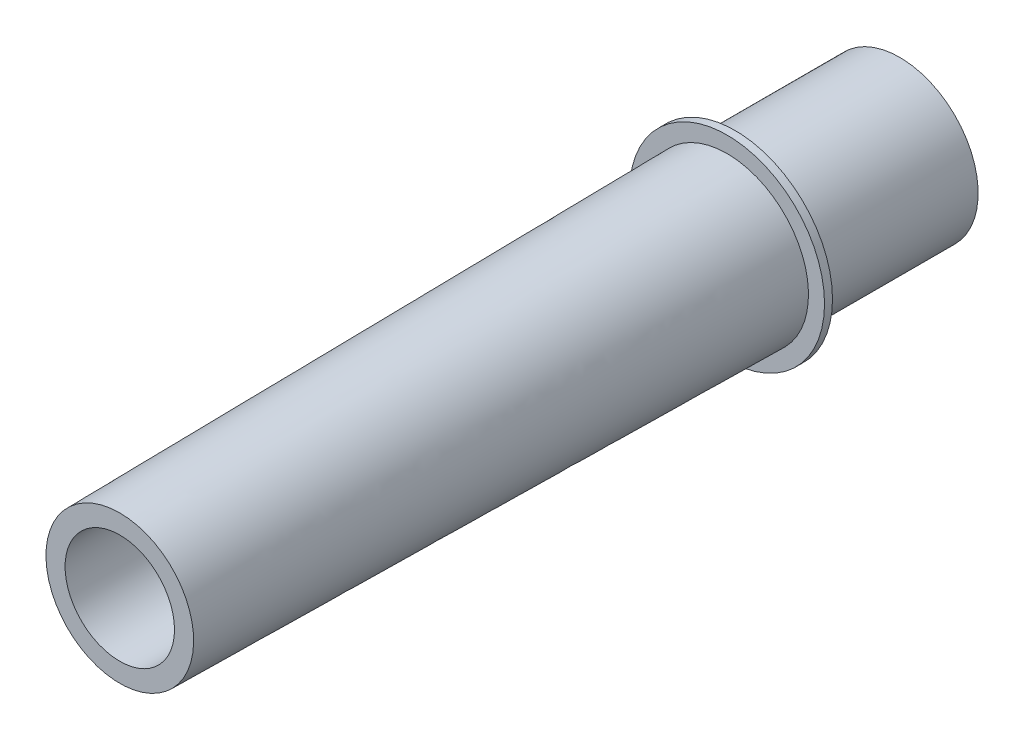
ISO-10303-21;
HEADER;
FILE_DESCRIPTION(('STEP AP214'),'2;1');
FILE_NAME('part.step','',(''),(''),'','','');
FILE_SCHEMA(('AUTOMOTIVE_DESIGN { 1 0 10303 214 1 1 1 1 }'));
ENDSEC;
DATA;
#1=APPLICATION_CONTEXT('core data for automotive mechanical design processes');
#2=APPLICATION_PROTOCOL_DEFINITION('international standard','automotive_design',2000,#1);
#3=PRODUCT_CONTEXT('',#1,'mechanical');
#4=PRODUCT('Part','Part','',(#3));
#5=PRODUCT_RELATED_PRODUCT_CATEGORY('part','',(#4));
#6=PRODUCT_DEFINITION_FORMATION('','',#4);
#7=PRODUCT_DEFINITION_CONTEXT('part definition',#1,'design');
#8=PRODUCT_DEFINITION('design','',#6,#7);
#9=PRODUCT_DEFINITION_SHAPE('','',#8);
#10=(LENGTH_UNIT() NAMED_UNIT(*) SI_UNIT(.MILLI.,.METRE.));
#11=(NAMED_UNIT(*) PLANE_ANGLE_UNIT() SI_UNIT($,.RADIAN.));
#12=(NAMED_UNIT(*) SI_UNIT($,.STERADIAN.) SOLID_ANGLE_UNIT());
#13=UNCERTAINTY_MEASURE_WITH_UNIT(LENGTH_MEASURE(1.E-05),#10,'distance_accuracy_value','');
#14=(GEOMETRIC_REPRESENTATION_CONTEXT(3) GLOBAL_UNCERTAINTY_ASSIGNED_CONTEXT((#13)) GLOBAL_UNIT_ASSIGNED_CONTEXT((#10,
#11,#12)) REPRESENTATION_CONTEXT('',''));
#15=CARTESIAN_POINT('',(0.,0.,0.));
#16=DIRECTION('',(0.,0.,1.));
#17=DIRECTION('',(1.,0.,0.));
#18=AXIS2_PLACEMENT_3D('',#15,#16,#17);
#19=CARTESIAN_POINT('',(-4.044182834782E-13,0.,-57.915));
#20=DIRECTION('',(0.,0.,-1.));
#21=DIRECTION('',(-1.,0.,0.));
#22=AXIS2_PLACEMENT_3D('',#19,#20,#21);
#23=PLANE('',#22);
#24=CARTESIAN_POINT('',(-4.044182834782E-13,0.,-57.915));
#25=DIRECTION('',(0.,0.,-1.));
#26=DIRECTION('',(-1.,0.,0.));
#27=AXIS2_PLACEMENT_3D('',#24,#25,#26);
#28=CIRCLE('',#27,9.175);
#29=CARTESIAN_POINT('',(-9.17500000000041,0.,-57.9149999999999));
#30=VERTEX_POINT('',#29);
#31=EDGE_CURVE('E220',#30,#30,#28,.T.);
#32=ORIENTED_EDGE('',*,*,#31,.T.);
#33=EDGE_LOOP('',(#32));
#34=FACE_BOUND('',#33,.T.);
#35=CARTESIAN_POINT('',(-4.044182834782E-13,0.,-57.915));
#36=DIRECTION('',(0.,0.,-1.));
#37=DIRECTION('',(-1.,0.,0.));
#38=AXIS2_PLACEMENT_3D('',#35,#36,#37);
#39=CIRCLE('',#38,7.385);
#40=CARTESIAN_POINT('',(-7.3850000000004,0.,-57.9149999999999));
#41=VERTEX_POINT('',#40);
#42=EDGE_CURVE('E216',#41,#41,#39,.T.);
#43=ORIENTED_EDGE('',*,*,#42,.F.);
#44=EDGE_LOOP('',(#43));
#45=FACE_BOUND('',#44,.T.);
#46=ADVANCED_FACE('F69',(#34,#45),#23,.T.);
#47=CARTESIAN_POINT('',(-4.044182834782E-13,0.,-57.915));
#48=DIRECTION('',(0.,0.,1.));
#49=DIRECTION('',(1.,0.,0.));
#50=AXIS2_PLACEMENT_3D('',#47,#48,#49);
#51=CYLINDRICAL_SURFACE('',#50,9.175);
#52=ORIENTED_EDGE('',*,*,#31,.F.);
#53=EDGE_LOOP('',(#52));
#54=FACE_BOUND('',#53,.T.);
#55=CARTESIAN_POINT('',(-3.99181061469935E-13,0.,-57.165));
#56=DIRECTION('',(0.,0.,-1.));
#57=DIRECTION('',(-1.,0.,0.));
#58=AXIS2_PLACEMENT_3D('',#55,#56,#57);
#59=CIRCLE('',#58,9.175);
#60=CARTESIAN_POINT('',(-9.1750000000004,0.,-57.1649999999999));
#61=VERTEX_POINT('',#60);
#62=EDGE_CURVE('E215',#61,#61,#59,.T.);
#63=ORIENTED_EDGE('',*,*,#62,.T.);
#64=EDGE_LOOP('',(#63));
#65=FACE_BOUND('',#64,.T.);
#66=ADVANCED_FACE('F267',(#54,#65),#51,.T.);
#67=CARTESIAN_POINT('',(-3.99181061469935E-13,0.,-57.165));
#68=DIRECTION('',(0.,0.,-1.));
#69=DIRECTION('',(-1.,0.,0.));
#70=AXIS2_PLACEMENT_3D('',#67,#68,#69);
#71=PLANE('',#70);
#72=CARTESIAN_POINT('',(0.,7.66034019812266,-57.165));
#73=CARTESIAN_POINT('',(-0.214754164555426,7.66034252430426,-57.165));
#74=CARTESIAN_POINT('',(-0.42948231080663,7.65147600431521,-57.165));
#75=CARTESIAN_POINT('',(-0.857511818193008,7.61580617369745,-57.165));
#76=CARTESIAN_POINT('',(-1.07081286621911,7.58899904929142,-57.165));
#77=CARTESIAN_POINT('',(-1.49455561433877,7.51744548414391,-57.165));
#78=CARTESIAN_POINT('',(-1.70499493948846,7.47268498364166,-57.165));
#79=CARTESIAN_POINT('',(-2.12132384242382,7.36548169237139,-57.165));
#80=CARTESIAN_POINT('',(-2.32721338993496,7.3030387839816,-57.165));
#81=CARTESIAN_POINT('',(-2.73290107909009,7.16094492620307,-57.165));
#82=CARTESIAN_POINT('',(-2.93270088695508,7.08129873294256,-57.165));
#83=CARTESIAN_POINT('',(-3.32485695436423,6.9054061495146,-57.165));
#84=CARTESIAN_POINT('',(-3.51721308667674,6.80915947575537,-57.165));
#85=CARTESIAN_POINT('',(-3.89311407528026,6.60083279819263,-57.165));
#86=CARTESIAN_POINT('',(-4.07666014022035,6.48875497462325,-57.165));
#87=CARTESIAN_POINT('',(-4.43377041335497,6.24957089402701,-57.165));
#88=CARTESIAN_POINT('',(-4.60733128038266,6.12245964961411,-57.165));
#89=CARTESIAN_POINT('',(-4.94328551211293,5.85412450049406,-57.165));
#90=CARTESIAN_POINT('',(-5.10567454323835,5.71289517088318,-57.165));
#91=CARTESIAN_POINT('',(-5.41809559228608,5.41737277279518,-57.165));
#92=CARTESIAN_POINT('',(-5.56812758342351,5.26307967600276,-57.165));
#93=CARTESIAN_POINT('',(-5.8547959662379,4.94248812347328,-57.165));
#94=CARTESIAN_POINT('',(-5.99143114369355,4.77618858189856,-57.165));
#95=CARTESIAN_POINT('',(-6.25026167626016,4.43279247969263,-57.165));
#96=CARTESIAN_POINT('',(-6.37246173459692,4.25569946443982,-57.165));
#97=CARTESIAN_POINT('',(-6.60249362664876,3.89039593133997,-57.165));
#98=CARTESIAN_POINT('',(-6.71020057717885,3.7021067372871,-57.1649999999999));
#99=CARTESIAN_POINT('',(-6.90922108859708,3.317050513311,-57.1649999999999));
#100=CARTESIAN_POINT('',(-7.00053446361632,3.1202833872971,-57.1649999999999));
#101=CARTESIAN_POINT('',(-7.16603631854441,2.71968171955587,-57.1649999999999));
#102=CARTESIAN_POINT('',(-7.24022547431971,2.51584745712285,-57.1649999999999));
#103=CARTESIAN_POINT('',(-7.37090222297376,2.10258551880136,-57.1649999999999));
#104=CARTESIAN_POINT('',(-7.42739019573455,1.8931579630543,-57.1649999999999));
#105=CARTESIAN_POINT('',(-7.52171685125046,1.47273359926221,-57.1649999999999));
#106=CARTESIAN_POINT('',(-7.55976697368809,1.26178418502534,-57.1649999999999));
#107=CARTESIAN_POINT('',(-7.61801254466855,0.837430391018596,-57.1649999999999));
#108=CARTESIAN_POINT('',(-7.63820728123391,0.624025913697594,-57.1649999999999));
#109=CARTESIAN_POINT('',(-7.66084411228096,0.196257602566314,-57.1649999999999));
#110=CARTESIAN_POINT('',(-7.66328399721771,-0.0181063473264197,-57.1649999999999));
#111=CARTESIAN_POINT('',(-7.65047740888342,-0.44630505131502,-57.1649999999999));
#112=CARTESIAN_POINT('',(-7.63523125609446,-0.66013981492971,-57.1649999999999));
#113=CARTESIAN_POINT('',(-7.5866003684641,-1.08811058698197,-57.1649999999999));
#114=CARTESIAN_POINT('',(-7.55301946685601,-1.30222440769696,-57.1649999999999));
#115=CARTESIAN_POINT('',(-7.46772808693061,-1.72681046863541,-57.1649999999999));
#116=CARTESIAN_POINT('',(-7.41601764803374,-1.93728271677597,-57.1649999999999));
#117=CARTESIAN_POINT('',(-7.2948293597129,-2.35294969858645,-57.1649999999999));
#118=CARTESIAN_POINT('',(-7.22535921253524,-2.55814667774792,-57.1649999999999));
#119=CARTESIAN_POINT('',(-7.06914414261136,-2.96194332034597,-57.1649999999999));
#120=CARTESIAN_POINT('',(-6.98239279223632,-3.16054049686385,-57.1649999999999));
#121=CARTESIAN_POINT('',(-6.79346375779301,-3.54729967694881,-57.1649999999999));
#122=CARTESIAN_POINT('',(-6.69148386391063,-3.73555836349701,-57.1649999999999));
#123=CARTESIAN_POINT('',(-6.47209356877162,-4.10295271018611,-57.1649999999999));
#124=CARTESIAN_POINT('',(-6.3546774305143,-4.28208494389457,-57.165));
#125=CARTESIAN_POINT('',(-6.10533702752081,-4.62991446216083,-57.165));
#126=CARTESIAN_POINT('',(-5.97341456531364,-4.79861303912445,-57.165));
#127=CARTESIAN_POINT('',(-5.69593825041367,-5.12453216192409,-57.165));
#128=CARTESIAN_POINT('',(-5.55037817032784,-5.28174740519855,-57.165));
#129=CARTESIAN_POINT('',(-5.24523873214488,-5.58498553955747,-57.165));
#130=CARTESIAN_POINT('',(-5.08553833487678,-5.73088666101346,-57.165));
#131=CARTESIAN_POINT('',(-4.75452255494261,-6.0086982405318,-57.165));
#132=CARTESIAN_POINT('',(-4.58321244927465,-6.14061498596276,-57.165));
#133=CARTESIAN_POINT('',(-4.23006832498448,-6.38957861062641,-57.165));
#134=CARTESIAN_POINT('',(-4.04823278391565,-6.5066233308396,-57.165));
#135=CARTESIAN_POINT('',(-3.67539005495219,-6.72488368994425,-57.165));
#136=CARTESIAN_POINT('',(-3.4843864458212,-6.82610544071467,-57.165));
#137=CARTESIAN_POINT('',(-3.09434458972314,-7.01204342210173,-57.165));
#138=CARTESIAN_POINT('',(-2.89530093243786,-7.09674830704605,-57.165));
#139=CARTESIAN_POINT('',(-2.4907972706167,-7.24886785012161,-57.165));
#140=CARTESIAN_POINT('',(-2.28533971873554,-7.31628902880033,-57.165));
#141=CARTESIAN_POINT('',(-1.86934045797826,-7.4333962258954,-57.165));
#142=CARTESIAN_POINT('',(-1.65879669514675,-7.48307494712735,-57.165));
#143=CARTESIAN_POINT('',(-1.23424571093726,-7.56434711065712,-57.165));
#144=CARTESIAN_POINT('',(-1.0202384520129,-7.59594035676233,-57.165));
#145=CARTESIAN_POINT('',(-0.59247096801242,-7.6407065273029,-57.165));
#146=CARTESIAN_POINT('',(-0.378729519622585,-7.65405981629305,-57.165));
#147=CARTESIAN_POINT('',(0.0491271393980998,-7.66313794473576,-57.165));
#148=CARTESIAN_POINT('',(0.263242353943535,-7.65886259843661,-57.165));
#149=CARTESIAN_POINT('',(0.690358592740463,-7.632563549706,-57.165));
#150=CARTESIAN_POINT('',(0.903359762804811,-7.61054223161072,-57.165));
#151=CARTESIAN_POINT('',(1.32675648621822,-7.5486912633504,-57.165));
#152=CARTESIAN_POINT('',(1.53715213138369,-7.50886224255888,-57.165));
#153=CARTESIAN_POINT('',(1.95632188307801,-7.41102117028068,-57.165));
#154=CARTESIAN_POINT('',(2.16504676081015,-7.35279802144047,-57.165));
#155=CARTESIAN_POINT('',(2.57676470451121,-7.21873662552197,-57.165));
#156=CARTESIAN_POINT('',(2.77975764263453,-7.14289798589401,-57.165));
#157=CARTESIAN_POINT('',(3.17855095939661,-6.97419639854737,-57.165));
#158=CARTESIAN_POINT('',(3.37435099634967,-6.88133264333354,-57.165));
#159=CARTESIAN_POINT('',(3.75735771139356,-6.67932173127452,-57.165));
#160=CARTESIAN_POINT('',(3.94456449912983,-6.57017478227007,-57.165));
#161=CARTESIAN_POINT('',(4.30708618323674,-6.33772698360539,-57.165));
#162=CARTESIAN_POINT('',(4.48250869486153,-6.21459387853564,-57.165));
#163=CARTESIAN_POINT('',(4.82254226426769,-5.95409470066452,-57.165));
#164=CARTESIAN_POINT('',(4.98714956124872,-5.81672371924422,-57.165));
#165=CARTESIAN_POINT('',(5.30435662802663,-5.52877344851365,-57.165));
#166=CARTESIAN_POINT('',(5.4569570900175,-5.37819492167824,-57.165));
#167=CARTESIAN_POINT('',(5.74910611265685,-5.06486789053832,-57.165));
#168=CARTESIAN_POINT('',(5.88865464655416,-4.90211936129144,-57.165));
#169=CARTESIAN_POINT('',(6.15530017811524,-4.56353973263963,-57.165));
#170=CARTESIAN_POINT('',(6.28222767934416,-4.38757508804794,-57.165));
#171=CARTESIAN_POINT('',(6.52068988502852,-4.02562179240167,-57.165));
#172=CARTESIAN_POINT('',(6.63223159228267,-3.83963775560086,-57.165));
#173=CARTESIAN_POINT('',(6.83914008105295,-3.45883968687893,-57.165));
#174=CARTESIAN_POINT('',(6.93450433011823,-3.26402427851539,-57.165));
#175=CARTESIAN_POINT('',(7.1082462070829,-2.86704438853964,-57.165));
#176=CARTESIAN_POINT('',(7.18663011555479,-2.66488265655461,-57.165));
#177=CARTESIAN_POINT('',(7.3253256535244,-2.25611211524735,-57.165));
#178=CARTESIAN_POINT('',(7.38576606721206,-2.0495469954382,-57.165));
#179=CARTESIAN_POINT('',(7.48891157942507,-1.63204045948581,-57.165));
#180=CARTESIAN_POINT('',(7.53161704907159,-1.42109913501596,-57.1650000000001));
#181=CARTESIAN_POINT('',(7.59906866304963,-0.996299333761107,-57.1650000000001));
#182=CARTESIAN_POINT('',(7.62380913248027,-0.78243995691783,-57.1650000000001));
#183=CARTESIAN_POINT('',(7.65531989071674,-0.353403426577019,-57.1650000000001));
#184=CARTESIAN_POINT('',(7.66208966529913,-0.138226235547403,-57.1650000000001));
#185=CARTESIAN_POINT('',(7.65783161539914,0.292176871172511,-57.1650000000001));
#186=CARTESIAN_POINT('',(7.64678532550545,0.507402605950289,-57.1650000000001));
#187=CARTESIAN_POINT('',(7.60664376341617,0.936159296402493,-57.1650000000001));
#188=CARTESIAN_POINT('',(7.57754959081719,1.14969035452518,-57.1650000000001));
#189=CARTESIAN_POINT('',(7.50139752657059,1.57345559391729,-57.1650000000001));
#190=CARTESIAN_POINT('',(7.45434543489665,1.78369081686186,-57.1650000000001));
#191=CARTESIAN_POINT('',(7.34255691709456,2.19941180513681,-57.165));
#192=CARTESIAN_POINT('',(7.27782009650466,2.40489746441625,-57.165));
#193=CARTESIAN_POINT('',(7.13124308174527,2.80935614719467,-57.165));
#194=CARTESIAN_POINT('',(7.04942637046044,3.00833768314131,-57.165));
#195=CARTESIAN_POINT('',(6.86924084035071,3.39874810219833,-57.1650000000001));
#196=CARTESIAN_POINT('',(6.77086584320827,3.59017413312309,-57.165));
#197=CARTESIAN_POINT('',(6.55836722554349,3.96403897622313,-57.165));
#198=CARTESIAN_POINT('',(6.44424573125784,4.14647899726637,-57.165));
#199=CARTESIAN_POINT('',(6.20106876206639,4.5012116578453,-57.165));
#200=CARTESIAN_POINT('',(6.07200801382043,4.67350068164489,-57.165));
#201=CARTESIAN_POINT('',(5.79992312025032,5.00669737268075,-57.165));
#202=CARTESIAN_POINT('',(5.65689784721692,5.16760411892544,-57.165));
#203=CARTESIAN_POINT('',(5.35791024657689,5.4769122965762,-57.165));
#204=CARTESIAN_POINT('',(5.20194790028356,5.62531370991855,-57.165));
#205=CARTESIAN_POINT('',(4.87811220636381,5.90861620585184,-57.165));
#206=CARTESIAN_POINT('',(4.71023474633452,6.04351258818969,-57.165));
#207=CARTESIAN_POINT('',(4.36382830841757,6.29872248973551,-57.165));
#208=CARTESIAN_POINT('',(4.18530307174453,6.41904108648952,-57.165));
#209=CARTESIAN_POINT('',(3.8172563816543,6.64517586355847,-57.165));
#210=CARTESIAN_POINT('',(3.62765642383661,6.7508643398003,-57.165));
#211=CARTESIAN_POINT('',(3.24022134090186,6.94568553849737,-57.165));
#212=CARTESIAN_POINT('',(3.04238931923304,7.03482443207169,-57.165));
#213=CARTESIAN_POINT('',(2.64003021941508,7.1958058371258,-57.165));
#214=CARTESIAN_POINT('',(2.43550994334108,7.26766533651813,-57.165));
#215=CARTESIAN_POINT('',(2.02114651969514,7.39362759781162,-57.165));
#216=CARTESIAN_POINT('',(1.81130482494727,7.44773515120397,-57.165));
#217=CARTESIAN_POINT('',(1.33690147904215,7.5486679387488,-57.165));
#218=CARTESIAN_POINT('',(1.07129181521038,7.59063034282988,-57.165));
#219=CARTESIAN_POINT('',(0.537108204655371,7.64646740595463,-57.165));
#220=CARTESIAN_POINT('',(0.268533761735431,7.66033728940936,-57.165));
#221=CARTESIAN_POINT('',(0.,7.66034019812266,-57.165));
#222=B_SPLINE_CURVE_WITH_KNOTS('',3,(#72,#73,#74,#75,#76,#77,#78,#79,#80,#81,#82,#83,#84,#85,
#86,#87,#88,#89,#90,#91,#92,#93,#94,#95,#96,#97,#98,#99,#100,#101,#102,#103,#104,#105,#106,#107,
#108,#109,#110,#111,#112,#113,#114,#115,#116,#117,#118,#119,#120,#121,#122,#123,#124,#125,#126,
#127,#128,#129,#130,#131,#132,#133,#134,#135,#136,#137,#138,#139,#140,#141,#142,#143,#144,#145,
#146,#147,#148,#149,#150,#151,#152,#153,#154,#155,#156,#157,#158,#159,#160,#161,#162,#163,#164,
#165,#166,#167,#168,#169,#170,#171,#172,#173,#174,#175,#176,#177,#178,#179,#180,#181,#182,#183,
#184,#185,#186,#187,#188,#189,#190,#191,#192,#193,#194,#195,#196,#197,#198,#199,#200,#201,#202,
#203,#204,#205,#206,#207,#208,#209,#210,#211,#212,#213,#214,#215,#216,#217,#218,#219,#220,#221),
.UNSPECIFIED.,.T.,.F.,(4,2,2,2,2,2,2,2,2,2,2,2,2,2,2,2,2,2,2,2,2,2,2,2,2,2,2,2,2,2,2,2,2,2,2,2,
2,2,2,2,2,2,2,2,2,2,2,2,2,2,2,2,2,2,2,2,2,2,2,2,2,2,2,2,2,2,2,2,2,2,2,2,2,2,4),(0.,
0.644027896715907,1.28819274308156,1.93286303989793,2.57753762510348,3.22203420713089,
3.86654180040815,4.51096071977841,5.15559403008535,5.80047600123225,6.44535937017658,
7.09030113425267,7.73503218150471,8.38500459548228,9.03498437832399,9.68493850308078,
10.3348786783285,10.9771779517461,11.6195028354747,12.2619076534912,12.9043008309118,
13.5537057489103,14.2031092548668,14.8522315959959,15.5015958261911,16.1431609362881,
16.7849651667325,17.4266897376963,18.0687087832115,18.7168837151451,19.3647659808338,
20.0127421944642,20.6604674949703,21.3086361719015,21.956559956034,22.6047499146422,
23.2529469047308,23.8946866777422,24.5364332127386,25.1780935374992,25.8197311859998,
26.4690177059265,27.118318696166,27.7676504904899,28.4169739973692,29.0592002716339,
29.7016486995868,30.3440600632127,30.9864727434941,31.6365936852138,32.2864177429856,
32.9363434317986,33.5860283185324,34.2309308239997,34.8758198335674,35.5209124663473,
36.1660235579668,36.8118037029885,37.4575445066685,38.1030769279305,38.74862374911,
39.3932887951617,40.0381949175409,40.6830140438354,41.3280614800467,41.9731610504035,
42.618261552578,43.2635857988485,43.9086846239741,44.5591004258779,45.2092732071295,
45.8588041455709,46.5081596222869,47.3133306982374,48.1186386377863),.UNSPECIFIED.);
#223=CARTESIAN_POINT('',(0.,7.66034019812266,-57.165));
#224=VERTEX_POINT('',#223);
#225=EDGE_CURVE('E158',#224,#224,#222,.T.);
#226=ORIENTED_EDGE('',*,*,#225,.F.);
#227=EDGE_LOOP('',(#226));
#228=FACE_BOUND('',#227,.T.);
#229=ORIENTED_EDGE('',*,*,#62,.F.);
#230=EDGE_LOOP('',(#229));
#231=FACE_BOUND('',#230,.T.);
#232=ADVANCED_FACE('F245',(#228,#231),#71,.F.);
#233=CARTESIAN_POINT('',(0.,6.95,0.));
#234=CARTESIAN_POINT('',(0.,7.18833333333321,-19.18));
#235=CARTESIAN_POINT('',(0.,7.42666666666641,-38.36));
#236=CARTESIAN_POINT('',(0.,7.66499999999961,-57.54));
#237=CARTESIAN_POINT('',(0.191790465948278,6.95,0.));
#238=CARTESIAN_POINT('',(0.198367453149857,7.1883333333332,-19.18));
#239=CARTESIAN_POINT('',(0.204944440351436,7.4266666666664,-38.36));
#240=CARTESIAN_POINT('',(0.211521427553015,7.6649999999996,-57.54));
#241=CARTESIAN_POINT('',(0.571763304655176,6.93442904659483,0.));
#242=CARTESIAN_POINT('',(0.591370535486265,7.17222841198151,-19.18));
#243=CARTESIAN_POINT('',(0.610977766317354,7.4100277773682,-38.36));
#244=CARTESIAN_POINT('',(0.630584997148443,7.64782714275489,-57.54));
#245=CARTESIAN_POINT('',(1.12910385411423,6.86615418530388,0.));
#246=CARTESIAN_POINT('',(1.16782372249271,7.1016122305072,-19.18));
#247=CARTESIAN_POINT('',(1.20654359087118,7.33707027571052,-38.36));
#248=CARTESIAN_POINT('',(1.24526345924965,7.57252832091383,-57.54));
#249=CARTESIAN_POINT('',(1.67203126593967,6.75475532186207,0.));
#250=CARTESIAN_POINT('',(1.72936950839272,6.98639321419435,-19.18));
#251=CARTESIAN_POINT('',(1.78670775084577,7.21803110652664,-38.36));
#252=CARTESIAN_POINT('',(1.84404599329882,7.44966899885892,-57.54));
#253=CARTESIAN_POINT('',(4.83235033689657,5.83838470250001,0.));
#254=CARTESIAN_POINT('',(4.99806402950467,6.03859789493566,-19.18));
#255=CARTESIAN_POINT('',(5.16377772211276,6.23881108737131,-38.36));
#256=CARTESIAN_POINT('',(5.32949141472085,6.43902427980696,-57.54));
#257=CARTESIAN_POINT('',(6.95,3.06864745517243,0.));
#258=CARTESIAN_POINT('',(7.18833333333313,3.17387925039758,-19.18));
#259=CARTESIAN_POINT('',(7.42666666666626,3.27911104562273,-38.36));
#260=CARTESIAN_POINT('',(7.66499999999939,3.38434284084788,-57.5400000000001));
#261=CARTESIAN_POINT('',(6.95,-3.83580931896555,0.));
#262=CARTESIAN_POINT('',(7.188333333333,-3.96734906299728,-19.18));
#263=CARTESIAN_POINT('',(7.426666666666,-4.09888880702902,-38.36));
#264=CARTESIAN_POINT('',(7.66499999999899,-4.23042855106075,-57.5400000000001));
#265=CARTESIAN_POINT('',(3.83580931896554,-6.95,0.));
#266=CARTESIAN_POINT('',(3.96734906299688,-7.18833333333328,-19.18));
#267=CARTESIAN_POINT('',(4.09888880702821,-7.42666666666656,-38.36));
#268=CARTESIAN_POINT('',(4.23042855105955,-7.66499999999984,-57.54));
#269=CARTESIAN_POINT('',(-3.83580931896555,-6.95,0.));
#270=CARTESIAN_POINT('',(-3.96734906299741,-7.18833333333313,-19.18));
#271=CARTESIAN_POINT('',(-4.09888880702928,-7.42666666666626,-38.36));
#272=CARTESIAN_POINT('',(-4.23042855106115,-7.66499999999939,-57.54));
#273=CARTESIAN_POINT('',(-6.95,-3.83580931896554,0.));
#274=CARTESIAN_POINT('',(-7.18833333333341,-3.96734906299701,-19.18));
#275=CARTESIAN_POINT('',(-7.42666666666682,-4.09888880702848,-38.36));
#276=CARTESIAN_POINT('',(-7.66500000000024,-4.23042855105995,-57.5399999999999));
#277=CARTESIAN_POINT('',(-6.95,3.06864745517244,0.));
#278=CARTESIAN_POINT('',(-7.18833333333328,3.17387925039785,-19.18));
#279=CARTESIAN_POINT('',(-7.42666666666656,3.27911104562327,-38.36));
#280=CARTESIAN_POINT('',(-7.66499999999984,3.38434284084868,-57.5399999999999));
#281=CARTESIAN_POINT('',(-4.83235033689657,5.83838470250001,0.));
#282=CARTESIAN_POINT('',(-4.99806402950471,6.03859789493584,-19.18));
#283=CARTESIAN_POINT('',(-5.16377772211284,6.23881108737168,-38.36));
#284=CARTESIAN_POINT('',(-5.32949141472098,6.43902427980752,-57.54));
#285=CARTESIAN_POINT('',(-1.67203126593966,6.75475532186207,0.));
#286=CARTESIAN_POINT('',(-1.72936950839272,6.98639321419442,-19.18));
#287=CARTESIAN_POINT('',(-1.78670775084579,7.21803110652677,-38.36));
#288=CARTESIAN_POINT('',(-1.84404599329885,7.44966899885911,-57.54));
#289=CARTESIAN_POINT('',(-1.12910385411423,6.86615418530388,0.));
#290=CARTESIAN_POINT('',(-1.16782372249271,7.10161223050724,-19.18));
#291=CARTESIAN_POINT('',(-1.20654359087119,7.3370702757106,-38.36));
#292=CARTESIAN_POINT('',(-1.24526345924967,7.57252832091396,-57.54));
#293=CARTESIAN_POINT('',(-0.571763304655175,6.93442904659483,0.));
#294=CARTESIAN_POINT('',(-0.591370535486266,7.17222841198153,-19.18));
#295=CARTESIAN_POINT('',(-0.610977766317358,7.41002777736824,-38.36));
#296=CARTESIAN_POINT('',(-0.630584997148449,7.64782714275495,-57.54));
#297=CARTESIAN_POINT('',(-0.191790465948275,6.95,0.));
#298=CARTESIAN_POINT('',(-0.198367453149856,7.18833333333321,-19.18));
#299=CARTESIAN_POINT('',(-0.204944440351437,7.42666666666642,-38.36));
#300=CARTESIAN_POINT('',(-0.211521427553018,7.66499999999963,-57.54));
#301=CARTESIAN_POINT('',(0.,6.95,0.));
#302=CARTESIAN_POINT('',(0.,7.18833333333321,-19.18));
#303=CARTESIAN_POINT('',(0.,7.42666666666641,-38.36));
#304=CARTESIAN_POINT('',(0.,7.66499999999961,-57.54));
#305=B_SPLINE_SURFACE_WITH_KNOTS('',3,3,((#233,#234,#235,#236),(#237,#238,#239,#240),(#241,#242,
#243,#244),(#245,#246,#247,#248),(#249,#250,#251,#252),(#253,#254,#255,#256),(#257,#258,#259,
#260),(#261,#262,#263,#264),(#265,#266,#267,#268),(#269,#270,#271,#272),(#273,#274,#275,#276),
(#277,#278,#279,#280),(#281,#282,#283,#284),(#285,#286,#287,#288),(#289,#290,#291,#292),(#293,
#294,#295,#296),(#297,#298,#299,#300),(#301,#302,#303,#304)),.UNSPECIFIED.,.T.,.F.,.F.,(4,1,1,1,
1,2,2,2,1,1,1,1,4),(4,4),(0.,0.0125,0.0249999999999999,0.0375000000000001,0.05,0.25,0.5,0.75,
0.95,0.9625,0.975,0.9875,1.),(0.,1.),.UNSPECIFIED.);
#306=CARTESIAN_POINT('',(0.,0.,0.));
#307=DIRECTION('',(0.,0.,1.));
#308=DIRECTION('',(1.,0.,0.));
#309=AXIS2_PLACEMENT_3D('',#306,#307,#308);
#310=CIRCLE('',#309,6.95);
#311=CARTESIAN_POINT('',(0.,6.95,0.));
#312=VERTEX_POINT('',#311);
#313=EDGE_CURVE('E154',#312,#312,#310,.T.);
#314=CARTESIAN_POINT('',(0.,6.95,0.));
#315=CARTESIAN_POINT('',(0.,6.95739937706378,-0.59546875));
#316=CARTESIAN_POINT('',(0.,6.96479875412756,-1.1909375));
#317=CARTESIAN_POINT('',(0.,6.97959750825511,-2.381875));
#318=CARTESIAN_POINT('',(0.,6.98699688531889,-2.97734375));
#319=CARTESIAN_POINT('',(0.,7.00179563944644,-4.16828125));
#320=CARTESIAN_POINT('',(0.,7.00919501651022,-4.76375));
#321=CARTESIAN_POINT('',(0.,7.02399377063778,-5.9546875));
#322=CARTESIAN_POINT('',(0.,7.03139314770155,-6.55015625));
#323=CARTESIAN_POINT('',(0.,7.04619190182911,-7.74109375));
#324=CARTESIAN_POINT('',(0.,7.05359127889289,-8.3365625));
#325=CARTESIAN_POINT('',(0.,7.06839003302045,-9.5275));
#326=CARTESIAN_POINT('',(0.,7.07578941008422,-10.12296875));
#327=CARTESIAN_POINT('',(0.,7.09058816421178,-11.31390625));
#328=CARTESIAN_POINT('',(0.,7.09798754127555,-11.909375));
#329=CARTESIAN_POINT('',(0.,7.11278629540311,-13.1003125));
#330=CARTESIAN_POINT('',(0.,7.12018567246689,-13.69578125));
#331=CARTESIAN_POINT('',(0.,7.13498442659444,-14.88671875));
#332=CARTESIAN_POINT('',(0.,7.14238380365822,-15.4821875));
#333=CARTESIAN_POINT('',(0.,7.15718255778578,-16.673125));
#334=CARTESIAN_POINT('',(0.,7.16458193484956,-17.26859375));
#335=CARTESIAN_POINT('',(0.,7.17938068897711,-18.45953125));
#336=CARTESIAN_POINT('',(0.,7.18678006604089,-19.055));
#337=CARTESIAN_POINT('',(0.,7.20157882016844,-20.2459375));
#338=CARTESIAN_POINT('',(0.,7.20897819723222,-20.84140625));
#339=CARTESIAN_POINT('',(0.,7.22377695135978,-22.03234375));
#340=CARTESIAN_POINT('',(0.,7.23117632842356,-22.6278125));
#341=CARTESIAN_POINT('',(0.,7.24597508255111,-23.81875));
#342=CARTESIAN_POINT('',(0.,7.25337445961489,-24.41421875));
#343=CARTESIAN_POINT('',(0.,7.26817321374244,-25.60515625));
#344=CARTESIAN_POINT('',(0.,7.27557259080622,-26.200625));
#345=CARTESIAN_POINT('',(0.,7.29037134493377,-27.3915625));
#346=CARTESIAN_POINT('',(0.,7.29777072199755,-27.98703125));
#347=CARTESIAN_POINT('',(0.,7.31256947612511,-29.17796875));
#348=CARTESIAN_POINT('',(0.,7.31996885318889,-29.7734375));
#349=CARTESIAN_POINT('',(0.,7.33476760731644,-30.964375));
#350=CARTESIAN_POINT('',(0.,7.34216698438022,-31.55984375));
#351=CARTESIAN_POINT('',(0.,7.35696573850778,-32.75078125));
#352=CARTESIAN_POINT('',(0.,7.36436511557155,-33.34625));
#353=CARTESIAN_POINT('',(0.,7.37916386969911,-34.5371875));
#354=CARTESIAN_POINT('',(0.,7.38656324676289,-35.13265625));
#355=CARTESIAN_POINT('',(0.,7.40136200089044,-36.32359375));
#356=CARTESIAN_POINT('',(0.,7.40876137795422,-36.9190625));
#357=CARTESIAN_POINT('',(0.,7.42356013208178,-38.11));
#358=CARTESIAN_POINT('',(0.,7.43095950914555,-38.70546875));
#359=CARTESIAN_POINT('',(0.,7.44575826327311,-39.89640625));
#360=CARTESIAN_POINT('',(0.,7.45315764033689,-40.491875));
#361=CARTESIAN_POINT('',(0.,7.46795639446444,-41.6828125));
#362=CARTESIAN_POINT('',(0.,7.47535577152822,-42.27828125));
#363=CARTESIAN_POINT('',(0.,7.49015452565577,-43.46921875));
#364=CARTESIAN_POINT('',(0.,7.49755390271955,-44.0646875));
#365=CARTESIAN_POINT('',(0.,7.51235265684711,-45.255625));
#366=CARTESIAN_POINT('',(0.,7.51975203391089,-45.85109375));
#367=CARTESIAN_POINT('',(0.,7.53455078803844,-47.04203125));
#368=CARTESIAN_POINT('',(0.,7.54195016510222,-47.6375));
#369=CARTESIAN_POINT('',(0.,7.55674891922977,-48.8284375));
#370=CARTESIAN_POINT('',(0.,7.56414829629355,-49.42390625));
#371=CARTESIAN_POINT('',(0.,7.57894705042111,-50.61484375));
#372=CARTESIAN_POINT('',(0.,7.58634642748488,-51.2103125));
#373=CARTESIAN_POINT('',(0.,7.60114518161244,-52.40125));
#374=CARTESIAN_POINT('',(0.,7.60854455867622,-52.99671875));
#375=CARTESIAN_POINT('',(0.,7.62334331280377,-54.18765625));
#376=CARTESIAN_POINT('',(0.,7.63074268986755,-54.783125));
#377=CARTESIAN_POINT('',(0.,7.64554144399511,-55.9740625));
#378=CARTESIAN_POINT('',(0.,7.65294082105888,-56.56953125));
#379=CARTESIAN_POINT('',(0.,7.66034019812266,-57.165));
#380=B_SPLINE_CURVE_WITH_KNOTS('',3,(#314,#315,#316,#317,#318,#319,#320,#321,#322,#323,#324,
#325,#326,#327,#328,#329,#330,#331,#332,#333,#334,#335,#336,#337,#338,#339,#340,#341,#342,#343,
#344,#345,#346,#347,#348,#349,#350,#351,#352,#353,#354,#355,#356,#357,#358,#359,#360,#361,#362,
#363,#364,#365,#366,#367,#368,#369,#370,#371,#372,#373,#374,#375,#376,#377,#378,#379),
.UNSPECIFIED.,.F.,.F.,(4,2,2,2,2,2,2,2,2,2,2,2,2,2,2,2,2,2,2,2,2,2,2,2,2,2,2,2,2,2,2,2,4),(0.,
1.78654416320097,3.57308832640194,5.35963248960291,7.14617665280388,8.93272081600485,
10.7192649792058,12.5058091424068,14.2923533056078,16.0788974688087,17.8654416320097,
19.6519857952107,21.4385299584116,23.2250741216126,25.0116182848136,26.7981624480145,
28.5847066112155,30.3712507744165,32.1577949376175,33.9443391008184,35.7308832640194,
37.5174274272204,39.3039715904213,41.0905157536223,42.8770599168233,44.6636040800243,
46.4501482432252,48.2366924064262,50.0232365696272,51.8097807328281,53.5963248960291,
55.3828690592301,57.169413222431),.UNSPECIFIED.);
#381=EDGE_CURVE('BSEAM232',#312,#224,#380,.T.);
#382=ORIENTED_EDGE('',*,*,#313,.F.);
#383=ORIENTED_EDGE('',*,*,#225,.T.);
#384=ORIENTED_EDGE('',*,*,#381,.T.);
#385=ORIENTED_EDGE('',*,*,#381,.F.);
#386=EDGE_LOOP('',(#382,#384,#383,#385));
#387=FACE_BOUND('',#386,.T.);
#388=ADVANCED_FACE('F232',(#387),#305,.T.);
#389=CARTESIAN_POINT('',(0.,0.,0.));
#390=DIRECTION('',(0.,0.,1.));
#391=DIRECTION('',(1.,0.,0.));
#392=AXIS2_PLACEMENT_3D('',#389,#390,#391);
#393=PLANE('',#392);
#394=CARTESIAN_POINT('',(0.,0.,0.));
#395=DIRECTION('',(0.,0.,1.));
#396=DIRECTION('',(1.,0.,0.));
#397=AXIS2_PLACEMENT_3D('',#394,#395,#396);
#398=CIRCLE('',#397,5.15);
#399=CARTESIAN_POINT('',(5.15,0.,0.));
#400=VERTEX_POINT('',#399);
#401=EDGE_CURVE('E427',#400,#400,#398,.T.);
#402=ORIENTED_EDGE('',*,*,#401,.F.);
#403=EDGE_LOOP('',(#402));
#404=FACE_BOUND('',#403,.T.);
#405=ORIENTED_EDGE('',*,*,#313,.T.);
#406=EDGE_LOOP('',(#405));
#407=FACE_BOUND('',#406,.T.);
#408=ADVANCED_FACE('F244',(#404,#407),#393,.T.);
#409=CARTESIAN_POINT('',(-5.12654204982337E-13,0.,-73.415));
#410=DIRECTION('',(0.,0.,-1.));
#411=DIRECTION('',(-1.,0.,0.));
#412=AXIS2_PLACEMENT_3D('',#409,#410,#411);
#413=PLANE('',#412);
#414=CARTESIAN_POINT('',(-5.12654204982337E-13,0.,-73.415));
#415=DIRECTION('',(0.,0.,-1.));
#416=DIRECTION('',(-1.,0.,0.));
#417=AXIS2_PLACEMENT_3D('',#414,#415,#416);
#418=CIRCLE('',#417,7.385);
#419=CARTESIAN_POINT('',(-7.38500000000051,0.,-73.4149999999999));
#420=VERTEX_POINT('',#419);
#421=EDGE_CURVE('E212',#420,#420,#418,.T.);
#422=ORIENTED_EDGE('',*,*,#421,.T.);
#423=EDGE_LOOP('',(#422));
#424=FACE_BOUND('',#423,.T.);
#425=DIRECTION('',(0.707106781186547,0.707106781186548,0.));
#426=VECTOR('',#425,1.);
#427=CARTESIAN_POINT('',(-7.04985460843039,0.,-73.4149999999999));
#428=LINE('',#427,#426);
#429=CARTESIAN_POINT('',(-6.69630121783712,0.353553390593274,-73.4149999999999));
#430=VERTEX_POINT('',#429);
#431=CARTESIAN_POINT('',(-0.353553390593787,6.69630121783661,-73.415));
#432=VERTEX_POINT('',#431);
#433=EDGE_CURVE('E193',#430,#432,#428,.T.);
#434=ORIENTED_EDGE('',*,*,#433,.F.);
#435=CARTESIAN_POINT('',(-6.34274782724384,0.,-73.415));
#436=DIRECTION('',(0.,0.,-1.));
#437=DIRECTION('',(-1.,0.,0.));
#438=AXIS2_PLACEMENT_3D('',#435,#436,#437);
#439=CIRCLE('',#438,0.5);
#440=CARTESIAN_POINT('',(-6.69630121783712,-0.353553390593274,-73.415));
#441=VERTEX_POINT('',#440);
#442=EDGE_CURVE('E188',#430,#441,#439,.F.);
#443=ORIENTED_EDGE('',*,*,#442,.T.);
#444=DIRECTION('',(-0.707106781186548,0.707106781186547,0.));
#445=VECTOR('',#444,1.);
#446=CARTESIAN_POINT('',(-5.09151943238975E-13,-7.04985460842988,-73.415));
#447=LINE('',#446,#445);
#448=CARTESIAN_POINT('',(-0.353553390593783,-6.69630121783661,-73.415));
#449=VERTEX_POINT('',#448);
#450=EDGE_CURVE('E152',#449,#441,#447,.T.);
#451=ORIENTED_EDGE('',*,*,#450,.F.);
#452=CARTESIAN_POINT('',(-5.10008701937181E-13,-6.34274782724333,-73.415));
#453=DIRECTION('',(0.,0.,-1.));
#454=DIRECTION('',(-1.,0.,0.));
#455=AXIS2_PLACEMENT_3D('',#452,#453,#454);
#456=CIRCLE('',#455,0.5);
#457=CARTESIAN_POINT('',(0.353553390592766,-6.6963012178366,-73.415));
#458=VERTEX_POINT('',#457);
#459=EDGE_CURVE('E186',#449,#458,#456,.F.);
#460=ORIENTED_EDGE('',*,*,#459,.T.);
#461=DIRECTION('',(-0.707106781186547,-0.707106781186548,0.));
#462=VECTOR('',#461,1.);
#463=CARTESIAN_POINT('',(7.04985460842937,0.,-73.415));
#464=LINE('',#463,#462);
#465=CARTESIAN_POINT('',(6.69630121783609,-0.353553390593273,-73.415));
#466=VERTEX_POINT('',#465);
#467=EDGE_CURVE('E219',#466,#458,#464,.T.);
#468=ORIENTED_EDGE('',*,*,#467,.F.);
#469=CARTESIAN_POINT('',(6.34274782724282,0.,-73.415));
#470=DIRECTION('',(0.,0.,-1.));
#471=DIRECTION('',(-1.,0.,0.));
#472=AXIS2_PLACEMENT_3D('',#469,#470,#471);
#473=CIRCLE('',#472,0.5);
#474=CARTESIAN_POINT('',(6.69630121783609,0.353553390593274,-73.415));
#475=VERTEX_POINT('',#474);
#476=EDGE_CURVE('E13',#466,#475,#473,.F.);
#477=ORIENTED_EDGE('',*,*,#476,.T.);
#478=DIRECTION('',(0.707106781186548,-0.707106781186547,0.));
#479=VECTOR('',#478,1.);
#480=CARTESIAN_POINT('',(-5.13819470784057E-13,7.04985460842988,-73.415));
#481=LINE('',#480,#479);
#482=CARTESIAN_POINT('',(0.35355339059276,6.69630121783661,-73.415));
#483=VERTEX_POINT('',#482);
#484=EDGE_CURVE('E195',#483,#475,#481,.T.);
#485=ORIENTED_EDGE('',*,*,#484,.F.);
#486=CARTESIAN_POINT('',(-5.14345510627123E-13,6.34274782724333,-73.415));
#487=DIRECTION('',(0.,0.,-1.));
#488=DIRECTION('',(-1.,0.,0.));
#489=AXIS2_PLACEMENT_3D('',#486,#487,#488);
#490=CIRCLE('',#489,0.5);
#491=EDGE_CURVE('E77',#483,#432,#490,.F.);
#492=ORIENTED_EDGE('',*,*,#491,.T.);
#493=EDGE_LOOP('',(#434,#443,#451,#460,#468,#477,#485,#492));
#494=FACE_BOUND('',#493,.T.);
#495=ADVANCED_FACE('F192',(#424,#494),#413,.T.);
#496=CARTESIAN_POINT('',(-5.12654204982337E-13,0.,-73.415));
#497=DIRECTION('',(0.,0.,1.));
#498=DIRECTION('',(1.,0.,0.));
#499=AXIS2_PLACEMENT_3D('',#496,#497,#498);
#500=CYLINDRICAL_SURFACE('',#499,7.385);
#501=ORIENTED_EDGE('',*,*,#421,.F.);
#502=EDGE_LOOP('',(#501));
#503=FACE_BOUND('',#502,.T.);
#504=ORIENTED_EDGE('',*,*,#42,.T.);
#505=EDGE_LOOP('',(#504));
#506=FACE_BOUND('',#505,.T.);
#507=ADVANCED_FACE('F298',(#503,#506),#500,.T.);
#508=CARTESIAN_POINT('',(-5.09151943238975E-13,-7.04985460842988,-73.415));
#509=DIRECTION('',(0.707106781186547,0.707106781186548,0.));
#510=DIRECTION('',(-0.707106781186548,0.707106781186547,0.));
#511=AXIS2_PLACEMENT_3D('',#508,#509,#510);
#512=PLANE('',#511);
#513=DIRECTION('',(-0.707106781186548,0.707106781186547,0.));
#514=VECTOR('',#513,1.);
#515=CARTESIAN_POINT('',(-4.00916021734838E-13,-7.04985460842988,-57.915));
#516=LINE('',#515,#514);
#517=CARTESIAN_POINT('',(-0.353553390593674,-6.69630121783661,-57.915));
#518=VERTEX_POINT('',#517);
#519=CARTESIAN_POINT('',(-6.69630121783701,-0.353553390593274,-57.9149999999999));
#520=VERTEX_POINT('',#519);
#521=EDGE_CURVE('E208',#518,#520,#516,.T.);
#522=ORIENTED_EDGE('',*,*,#521,.F.);
#523=DIRECTION('',(0.,0.,1.));
#524=VECTOR('',#523,1.);
#525=CARTESIAN_POINT('',(-0.353553390593783,-6.69630121783661,-73.415));
#526=LINE('',#525,#524);
#527=EDGE_CURVE('E176',#518,#449,#526,.F.);
#528=ORIENTED_EDGE('',*,*,#527,.T.);
#529=ORIENTED_EDGE('',*,*,#450,.T.);
#530=DIRECTION('',(0.,0.,1.));
#531=VECTOR('',#530,1.);
#532=CARTESIAN_POINT('',(-6.69630121783701,-0.353553390593275,-57.9149999999999));
#533=LINE('',#532,#531);
#534=EDGE_CURVE('E173',#441,#520,#533,.T.);
#535=ORIENTED_EDGE('',*,*,#534,.T.);
#536=EDGE_LOOP('',(#522,#528,#529,#535));
#537=FACE_BOUND('',#536,.T.);
#538=ADVANCED_FACE('F295',(#537),#512,.T.);
#539=CARTESIAN_POINT('',(-7.04985460843039,0.,-73.4149999999999));
#540=DIRECTION('',(0.707106781186548,-0.707106781186547,0.));
#541=DIRECTION('',(0.707106781186547,0.707106781186548,0.));
#542=AXIS2_PLACEMENT_3D('',#539,#540,#541);
#543=PLANE('',#542);
#544=DIRECTION('',(0.707106781186547,0.707106781186548,0.));
#545=VECTOR('',#544,1.);
#546=CARTESIAN_POINT('',(-7.04985460843028,0.,-57.9149999999999));
#547=LINE('',#546,#545);
#548=CARTESIAN_POINT('',(-6.69630121783701,0.353553390593274,-57.9149999999999));
#549=VERTEX_POINT('',#548);
#550=CARTESIAN_POINT('',(-0.353553390593678,6.69630121783661,-57.915));
#551=VERTEX_POINT('',#550);
#552=EDGE_CURVE('E205',#549,#551,#547,.T.);
#553=ORIENTED_EDGE('',*,*,#552,.F.);
#554=DIRECTION('',(0.,0.,1.));
#555=VECTOR('',#554,1.);
#556=CARTESIAN_POINT('',(-6.69630121783712,0.353553390593274,-73.4149999999999));
#557=LINE('',#556,#555);
#558=EDGE_CURVE('E181',#549,#430,#557,.F.);
#559=ORIENTED_EDGE('',*,*,#558,.T.);
#560=ORIENTED_EDGE('',*,*,#433,.T.);
#561=DIRECTION('',(0.,0.,1.));
#562=VECTOR('',#561,1.);
#563=CARTESIAN_POINT('',(-0.35355339059368,6.69630121783661,-57.915));
#564=LINE('',#563,#562);
#565=EDGE_CURVE('E178',#432,#551,#564,.T.);
#566=ORIENTED_EDGE('',*,*,#565,.T.);
#567=EDGE_LOOP('',(#553,#559,#560,#566));
#568=FACE_BOUND('',#567,.T.);
#569=ADVANCED_FACE('F200',(#568),#543,.T.);
#570=CARTESIAN_POINT('',(-5.13819470784057E-13,7.04985460842988,-73.415));
#571=DIRECTION('',(-0.707106781186547,-0.707106781186548,0.));
#572=DIRECTION('',(0.707106781186548,-0.707106781186547,0.));
#573=AXIS2_PLACEMENT_3D('',#570,#571,#572);
#574=PLANE('',#573);
#575=DIRECTION('',(0.707106781186548,-0.707106781186547,0.));
#576=VECTOR('',#575,1.);
#577=CARTESIAN_POINT('',(-4.0558354927992E-13,7.04985460842988,-57.915));
#578=LINE('',#577,#576);
#579=CARTESIAN_POINT('',(0.353553390592868,6.69630121783661,-57.915));
#580=VERTEX_POINT('',#579);
#581=CARTESIAN_POINT('',(6.6963012178362,0.353553390593274,-57.915));
#582=VERTEX_POINT('',#581);
#583=EDGE_CURVE('E138',#580,#582,#578,.T.);
#584=ORIENTED_EDGE('',*,*,#583,.F.);
#585=DIRECTION('',(0.,0.,1.));
#586=VECTOR('',#585,1.);
#587=CARTESIAN_POINT('',(0.353553390592759,6.69630121783661,-73.415));
#588=LINE('',#587,#586);
#589=EDGE_CURVE('E89',#580,#483,#588,.F.);
#590=ORIENTED_EDGE('',*,*,#589,.T.);
#591=ORIENTED_EDGE('',*,*,#484,.T.);
#592=DIRECTION('',(0.,0.,1.));
#593=VECTOR('',#592,1.);
#594=CARTESIAN_POINT('',(6.6963012178362,0.353553390593274,-57.915));
#595=LINE('',#594,#593);
#596=EDGE_CURVE('E183',#475,#582,#595,.T.);
#597=ORIENTED_EDGE('',*,*,#596,.T.);
#598=EDGE_LOOP('',(#584,#590,#591,#597));
#599=FACE_BOUND('',#598,.T.);
#600=ADVANCED_FACE('F206',(#599),#574,.T.);
#601=CARTESIAN_POINT('',(7.04985460842937,0.,-73.415));
#602=DIRECTION('',(-0.707106781186548,0.707106781186547,0.));
#603=DIRECTION('',(-0.707106781186547,-0.707106781186548,0.));
#604=AXIS2_PLACEMENT_3D('',#601,#602,#603);
#605=PLANE('',#604);
#606=ORIENTED_EDGE('',*,*,#467,.T.);
#607=DIRECTION('',(0.,0.,1.));
#608=VECTOR('',#607,1.);
#609=CARTESIAN_POINT('',(0.353553390592872,-6.69630121783661,-57.915));
#610=LINE('',#609,#608);
#611=CARTESIAN_POINT('',(0.353553390592874,-6.6963012178366,-57.915));
#612=VERTEX_POINT('',#611);
#613=EDGE_CURVE('E144',#458,#612,#610,.T.);
#614=ORIENTED_EDGE('',*,*,#613,.T.);
#615=DIRECTION('',(-0.707106781186547,-0.707106781186548,0.));
#616=VECTOR('',#615,1.);
#617=CARTESIAN_POINT('',(7.04985460842948,0.,-57.915));
#618=LINE('',#617,#616);
#619=CARTESIAN_POINT('',(6.6963012178362,-0.353553390593273,-57.915));
#620=VERTEX_POINT('',#619);
#621=EDGE_CURVE('E137',#620,#612,#618,.T.);
#622=ORIENTED_EDGE('',*,*,#621,.F.);
#623=DIRECTION('',(0.,0.,1.));
#624=VECTOR('',#623,1.);
#625=CARTESIAN_POINT('',(6.69630121783609,-0.353553390593273,-73.4150000000001));
#626=LINE('',#625,#624);
#627=EDGE_CURVE('E150',#620,#466,#626,.F.);
#628=ORIENTED_EDGE('',*,*,#627,.T.);
#629=EDGE_LOOP('',(#606,#614,#622,#628));
#630=FACE_BOUND('',#629,.T.);
#631=ADVANCED_FACE('F149',(#630),#605,.T.);
#632=ORIENTED_EDGE('',*,*,#621,.T.);
#633=CARTESIAN_POINT('',(-4.01772780433044E-13,-6.34274782724333,-57.915));
#634=DIRECTION('',(0.,0.,-1.));
#635=DIRECTION('',(-1.,0.,0.));
#636=AXIS2_PLACEMENT_3D('',#633,#634,#635);
#637=CIRCLE('',#636,0.5);
#638=EDGE_CURVE('E171',#612,#518,#637,.T.);
#639=ORIENTED_EDGE('',*,*,#638,.T.);
#640=ORIENTED_EDGE('',*,*,#521,.T.);
#641=CARTESIAN_POINT('',(-6.34274782724374,0.,-57.9149999999999));
#642=DIRECTION('',(0.,0.,-1.));
#643=DIRECTION('',(-1.,0.,0.));
#644=AXIS2_PLACEMENT_3D('',#641,#642,#643);
#645=CIRCLE('',#644,0.5);
#646=EDGE_CURVE('E169',#520,#549,#645,.T.);
#647=ORIENTED_EDGE('',*,*,#646,.T.);
#648=ORIENTED_EDGE('',*,*,#552,.T.);
#649=CARTESIAN_POINT('',(-4.06109589122986E-13,6.34274782724333,-57.915));
#650=DIRECTION('',(0.,0.,-1.));
#651=DIRECTION('',(-1.,0.,0.));
#652=AXIS2_PLACEMENT_3D('',#649,#650,#651);
#653=CIRCLE('',#652,0.5);
#654=EDGE_CURVE('E143',#551,#580,#653,.T.);
#655=ORIENTED_EDGE('',*,*,#654,.T.);
#656=ORIENTED_EDGE('',*,*,#583,.T.);
#657=CARTESIAN_POINT('',(6.34274782724293,0.,-57.915));
#658=DIRECTION('',(0.,0.,-1.));
#659=DIRECTION('',(-1.,0.,0.));
#660=AXIS2_PLACEMENT_3D('',#657,#658,#659);
#661=CIRCLE('',#660,0.5);
#662=EDGE_CURVE('E134',#582,#620,#661,.T.);
#663=ORIENTED_EDGE('',*,*,#662,.T.);
#664=EDGE_LOOP('',(#632,#639,#640,#647,#648,#655,#656,#663));
#665=FACE_BOUND('',#664,.T.);
#666=ADVANCED_FACE('F136',(#665),#23,.T.);
#667=CARTESIAN_POINT('',(-3.99181061469935E-13,0.,-57.165));
#668=DIRECTION('',(0.,0.,-1.));
#669=DIRECTION('',(-1.,0.,0.));
#670=AXIS2_PLACEMENT_3D('',#667,#668,#669);
#671=PLANE('',#670);
#672=CARTESIAN_POINT('',(0.,0.,-57.165));
#673=DIRECTION('',(0.,0.,-1.));
#674=DIRECTION('',(-1.,0.,0.));
#675=AXIS2_PLACEMENT_3D('',#672,#673,#674);
#676=CIRCLE('',#675,5.15);
#677=CARTESIAN_POINT('',(-5.15,0.,-57.165));
#678=VERTEX_POINT('',#677);
#679=EDGE_CURVE('E430',#678,#678,#676,.F.);
#680=ORIENTED_EDGE('',*,*,#679,.T.);
#681=EDGE_LOOP('',(#680));
#682=FACE_BOUND('',#681,.T.);
#683=ADVANCED_FACE('F279',(#682),#671,.F.);
#684=CARTESIAN_POINT('',(0.,0.,-71.7313996924429));
#685=DIRECTION('',(0.,0.,1.));
#686=DIRECTION('',(1.,0.,0.));
#687=AXIS2_PLACEMENT_3D('',#684,#685,#686);
#688=CYLINDRICAL_SURFACE('',#687,5.15);
#689=ORIENTED_EDGE('',*,*,#401,.T.);
#690=EDGE_LOOP('',(#689));
#691=FACE_BOUND('',#690,.T.);
#692=ORIENTED_EDGE('',*,*,#679,.F.);
#693=EDGE_LOOP('',(#692));
#694=FACE_BOUND('',#693,.T.);
#695=ADVANCED_FACE('F258',(#691,#694),#688,.F.);
#696=CARTESIAN_POINT('',(-5.10008701937181E-13,-6.34274782724333,-73.415));
#697=DIRECTION('',(0.,0.,-1.));
#698=DIRECTION('',(-1.,0.,0.));
#699=AXIS2_PLACEMENT_3D('',#696,#697,#698);
#700=CYLINDRICAL_SURFACE('',#699,0.5);
#701=ORIENTED_EDGE('',*,*,#459,.F.);
#702=ORIENTED_EDGE('',*,*,#527,.F.);
#703=ORIENTED_EDGE('',*,*,#638,.F.);
#704=ORIENTED_EDGE('',*,*,#613,.F.);
#705=EDGE_LOOP('',(#701,#702,#703,#704));
#706=FACE_BOUND('',#705,.T.);
#707=ADVANCED_FACE('F248',(#706),#700,.F.);
#708=CARTESIAN_POINT('',(-6.34274782724384,0.,-73.415));
#709=DIRECTION('',(0.,0.,-1.));
#710=DIRECTION('',(-1.,0.,0.));
#711=AXIS2_PLACEMENT_3D('',#708,#709,#710);
#712=CYLINDRICAL_SURFACE('',#711,0.5);
#713=ORIENTED_EDGE('',*,*,#442,.F.);
#714=ORIENTED_EDGE('',*,*,#558,.F.);
#715=ORIENTED_EDGE('',*,*,#646,.F.);
#716=ORIENTED_EDGE('',*,*,#534,.F.);
#717=EDGE_LOOP('',(#713,#714,#715,#716));
#718=FACE_BOUND('',#717,.T.);
#719=ADVANCED_FACE('F257',(#718),#712,.F.);
#720=CARTESIAN_POINT('',(-5.14345510627123E-13,6.34274782724333,-73.415));
#721=DIRECTION('',(0.,0.,-1.));
#722=DIRECTION('',(-1.,0.,0.));
#723=AXIS2_PLACEMENT_3D('',#720,#721,#722);
#724=CYLINDRICAL_SURFACE('',#723,0.5);
#725=ORIENTED_EDGE('',*,*,#491,.F.);
#726=ORIENTED_EDGE('',*,*,#589,.F.);
#727=ORIENTED_EDGE('',*,*,#654,.F.);
#728=ORIENTED_EDGE('',*,*,#565,.F.);
#729=EDGE_LOOP('',(#725,#726,#727,#728));
#730=FACE_BOUND('',#729,.T.);
#731=ADVANCED_FACE('F204',(#730),#724,.F.);
#732=CARTESIAN_POINT('',(6.34274782724282,0.,-73.415));
#733=DIRECTION('',(0.,0.,-1.));
#734=DIRECTION('',(-1.,0.,0.));
#735=AXIS2_PLACEMENT_3D('',#732,#733,#734);
#736=CYLINDRICAL_SURFACE('',#735,0.5);
#737=ORIENTED_EDGE('',*,*,#476,.F.);
#738=ORIENTED_EDGE('',*,*,#627,.F.);
#739=ORIENTED_EDGE('',*,*,#662,.F.);
#740=ORIENTED_EDGE('',*,*,#596,.F.);
#741=EDGE_LOOP('',(#737,#738,#739,#740));
#742=FACE_BOUND('',#741,.T.);
#743=ADVANCED_FACE('F71',(#742),#736,.F.);
#744=CLOSED_SHELL('',(#46,#66,#232,#388,#408,#495,#507,#538,#569,#600,#631,#666,#683,#695,#707,
#719,#731,#743));
#745=MANIFOLD_SOLID_BREP('B2',#744);
#746=ADVANCED_BREP_SHAPE_REPRESENTATION('',(#18,#745),#14);
#747=SHAPE_DEFINITION_REPRESENTATION(#9,#746);
ENDSEC;
END-ISO-10303-21;
